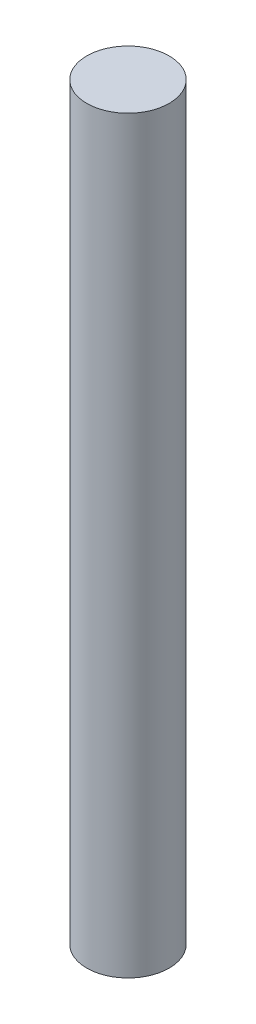
ISO-10303-21;
HEADER;
FILE_DESCRIPTION(('STEP AP214'),'2;1');
FILE_NAME('part.step','',(''),(''),'','','');
FILE_SCHEMA(('AUTOMOTIVE_DESIGN { 1 0 10303 214 1 1 1 1 }'));
ENDSEC;
DATA;
#1=APPLICATION_CONTEXT('core data for automotive mechanical design processes');
#2=APPLICATION_PROTOCOL_DEFINITION('international standard','automotive_design',2000,#1);
#3=PRODUCT_CONTEXT('',#1,'mechanical');
#4=PRODUCT('Part','Part','',(#3));
#5=PRODUCT_RELATED_PRODUCT_CATEGORY('part','',(#4));
#6=PRODUCT_DEFINITION_FORMATION('','',#4);
#7=PRODUCT_DEFINITION_CONTEXT('part definition',#1,'design');
#8=PRODUCT_DEFINITION('design','',#6,#7);
#9=PRODUCT_DEFINITION_SHAPE('','',#8);
#10=(LENGTH_UNIT() NAMED_UNIT(*) SI_UNIT(.MILLI.,.METRE.));
#11=(NAMED_UNIT(*) PLANE_ANGLE_UNIT() SI_UNIT($,.RADIAN.));
#12=(NAMED_UNIT(*) SI_UNIT($,.STERADIAN.) SOLID_ANGLE_UNIT());
#13=UNCERTAINTY_MEASURE_WITH_UNIT(LENGTH_MEASURE(1.E-05),#10,'distance_accuracy_value','');
#14=(GEOMETRIC_REPRESENTATION_CONTEXT(3) GLOBAL_UNCERTAINTY_ASSIGNED_CONTEXT((#13)) GLOBAL_UNIT_ASSIGNED_CONTEXT((#10,
#11,#12)) REPRESENTATION_CONTEXT('',''));
#15=CARTESIAN_POINT('',(0.,0.,0.));
#16=DIRECTION('',(0.,0.,1.));
#17=DIRECTION('',(1.,0.,0.));
#18=AXIS2_PLACEMENT_3D('',#15,#16,#17);
#19=CARTESIAN_POINT('',(0.,50.,0.));
#20=DIRECTION('',(0.,-1.,0.));
#21=DIRECTION('',(0.,0.,-1.));
#22=AXIS2_PLACEMENT_3D('',#19,#20,#21);
#23=CYLINDRICAL_SURFACE('',#22,2.75);
#24=CARTESIAN_POINT('',(0.,50.,0.));
#25=DIRECTION('',(0.,1.,0.));
#26=DIRECTION('',(0.,0.,1.));
#27=AXIS2_PLACEMENT_3D('',#24,#25,#26);
#28=CIRCLE('',#27,2.75);
#29=CARTESIAN_POINT('',(0.,50.,2.75));
#30=VERTEX_POINT('',#29);
#31=EDGE_CURVE('E10',#30,#30,#28,.T.);
#32=ORIENTED_EDGE('',*,*,#31,.F.);
#33=EDGE_LOOP('',(#32));
#34=FACE_BOUND('',#33,.T.);
#35=CARTESIAN_POINT('',(0.,0.,0.));
#36=DIRECTION('',(0.,1.,0.));
#37=DIRECTION('',(0.,0.,1.));
#38=AXIS2_PLACEMENT_3D('',#35,#36,#37);
#39=CIRCLE('',#38,2.75);
#40=CARTESIAN_POINT('',(0.,0.,2.75));
#41=VERTEX_POINT('',#40);
#42=EDGE_CURVE('E34',#41,#41,#39,.T.);
#43=ORIENTED_EDGE('',*,*,#42,.T.);
#44=EDGE_LOOP('',(#43));
#45=FACE_BOUND('',#44,.T.);
#46=ADVANCED_FACE('F31',(#34,#45),#23,.T.);
#47=CARTESIAN_POINT('',(0.,50.,0.));
#48=DIRECTION('',(0.,1.,0.));
#49=DIRECTION('',(0.,0.,1.));
#50=AXIS2_PLACEMENT_3D('',#47,#48,#49);
#51=PLANE('',#50);
#52=ORIENTED_EDGE('',*,*,#31,.T.);
#53=EDGE_LOOP('',(#52));
#54=FACE_BOUND('',#53,.T.);
#55=ADVANCED_FACE('F46',(#54),#51,.T.);
#56=CARTESIAN_POINT('',(0.,0.,0.));
#57=DIRECTION('',(0.,1.,0.));
#58=DIRECTION('',(0.,0.,1.));
#59=AXIS2_PLACEMENT_3D('',#56,#57,#58);
#60=PLANE('',#59);
#61=ORIENTED_EDGE('',*,*,#42,.F.);
#62=EDGE_LOOP('',(#61));
#63=FACE_BOUND('',#62,.T.);
#64=ADVANCED_FACE('F44',(#63),#60,.F.);
#65=CLOSED_SHELL('',(#46,#55,#64));
#66=MANIFOLD_SOLID_BREP('B2',#65);
#67=ADVANCED_BREP_SHAPE_REPRESENTATION('',(#18,#66),#14);
#68=SHAPE_DEFINITION_REPRESENTATION(#9,#67);
ENDSEC;
END-ISO-10303-21;
